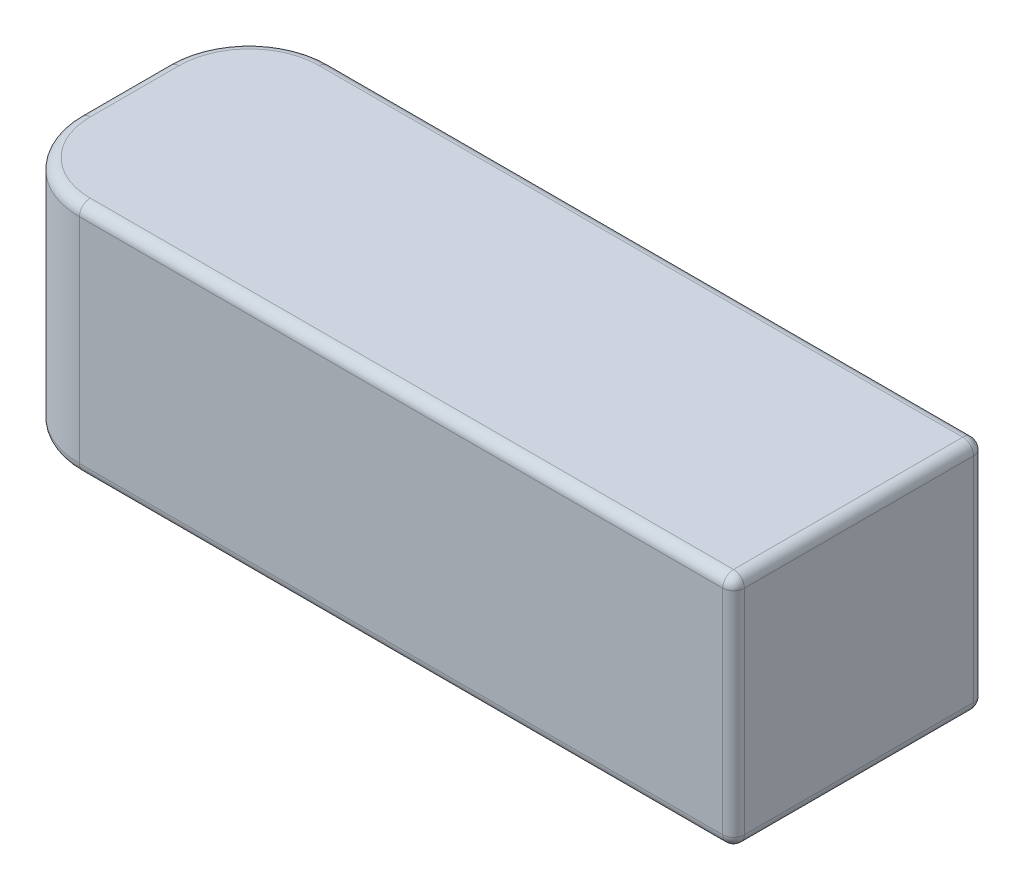
ISO-10303-21;
HEADER;
FILE_DESCRIPTION(('STEP AP214'),'2;1');
FILE_NAME('part.step','',(''),(''),'','','');
FILE_SCHEMA(('AUTOMOTIVE_DESIGN { 1 0 10303 214 1 1 1 1 }'));
ENDSEC;
DATA;
#1=APPLICATION_CONTEXT('core data for automotive mechanical design processes');
#2=APPLICATION_PROTOCOL_DEFINITION('international standard','automotive_design',2000,#1);
#3=PRODUCT_CONTEXT('',#1,'mechanical');
#4=PRODUCT('Part','Part','',(#3));
#5=PRODUCT_RELATED_PRODUCT_CATEGORY('part','',(#4));
#6=PRODUCT_DEFINITION_FORMATION('','',#4);
#7=PRODUCT_DEFINITION_CONTEXT('part definition',#1,'design');
#8=PRODUCT_DEFINITION('design','',#6,#7);
#9=PRODUCT_DEFINITION_SHAPE('','',#8);
#10=(LENGTH_UNIT() NAMED_UNIT(*) SI_UNIT(.MILLI.,.METRE.));
#11=(NAMED_UNIT(*) PLANE_ANGLE_UNIT() SI_UNIT($,.RADIAN.));
#12=(NAMED_UNIT(*) SI_UNIT($,.STERADIAN.) SOLID_ANGLE_UNIT());
#13=UNCERTAINTY_MEASURE_WITH_UNIT(LENGTH_MEASURE(1.E-05),#10,'distance_accuracy_value','');
#14=(GEOMETRIC_REPRESENTATION_CONTEXT(3) GLOBAL_UNCERTAINTY_ASSIGNED_CONTEXT((#13)) GLOBAL_UNIT_ASSIGNED_CONTEXT((#10,
#11,#12)) REPRESENTATION_CONTEXT('',''));
#15=CARTESIAN_POINT('',(0.,0.,0.));
#16=DIRECTION('',(0.,0.,1.));
#17=DIRECTION('',(1.,0.,0.));
#18=AXIS2_PLACEMENT_3D('',#15,#16,#17);
#19=CARTESIAN_POINT('',(68.,43.5,-23.2));
#20=DIRECTION('',(-1.,0.,0.));
#21=DIRECTION('',(0.,0.,1.));
#22=AXIS2_PLACEMENT_3D('',#19,#20,#21);
#23=PLANE('',#22);
#24=DIRECTION('',(0.,-1.,0.));
#25=VECTOR('',#24,1.);
#26=CARTESIAN_POINT('',(68.,43.5,-21.2));
#27=LINE('',#26,#25);
#28=CARTESIAN_POINT('',(68.,2.,-21.2));
#29=VERTEX_POINT('',#28);
#30=CARTESIAN_POINT('',(68.,41.5,-21.2));
#31=VERTEX_POINT('',#30);
#32=EDGE_CURVE('E164',#29,#31,#27,.F.);
#33=ORIENTED_EDGE('',*,*,#32,.T.);
#34=DIRECTION('',(0.,0.,-1.));
#35=VECTOR('',#34,1.);
#36=CARTESIAN_POINT('',(68.,41.5,23.2));
#37=LINE('',#36,#35);
#38=CARTESIAN_POINT('',(68.,41.5,21.2));
#39=VERTEX_POINT('',#38);
#40=EDGE_CURVE('E168',#31,#39,#37,.F.);
#41=ORIENTED_EDGE('',*,*,#40,.T.);
#42=DIRECTION('',(0.,-1.,0.));
#43=VECTOR('',#42,1.);
#44=CARTESIAN_POINT('',(68.,43.5,21.2));
#45=LINE('',#44,#43);
#46=CARTESIAN_POINT('',(68.,2.,21.2));
#47=VERTEX_POINT('',#46);
#48=EDGE_CURVE('E141',#39,#47,#45,.T.);
#49=ORIENTED_EDGE('',*,*,#48,.T.);
#50=DIRECTION('',(0.,0.,-1.));
#51=VECTOR('',#50,1.);
#52=CARTESIAN_POINT('',(68.,2.,-23.2));
#53=LINE('',#52,#51);
#54=EDGE_CURVE('E158',#47,#29,#53,.T.);
#55=ORIENTED_EDGE('',*,*,#54,.T.);
#56=EDGE_LOOP('',(#33,#41,#49,#55));
#57=FACE_BOUND('',#56,.T.);
#58=ADVANCED_FACE('F36',(#57),#23,.F.);
#59=CARTESIAN_POINT('',(-68.,43.5,-23.2));
#60=DIRECTION('',(0.,0.,1.));
#61=DIRECTION('',(1.,0.,0.));
#62=AXIS2_PLACEMENT_3D('',#59,#60,#61);
#63=PLANE('',#62);
#64=DIRECTION('',(0.,-1.,0.));
#65=VECTOR('',#64,1.);
#66=CARTESIAN_POINT('',(-53.,43.5,-23.2));
#67=LINE('',#66,#65);
#68=CARTESIAN_POINT('',(-53.,2.,-23.2));
#69=VERTEX_POINT('',#68);
#70=CARTESIAN_POINT('',(-53.,41.5,-23.2));
#71=VERTEX_POINT('',#70);
#72=EDGE_CURVE('E274',#69,#71,#67,.F.);
#73=ORIENTED_EDGE('',*,*,#72,.T.);
#74=DIRECTION('',(-1.,0.,0.));
#75=VECTOR('',#74,1.);
#76=CARTESIAN_POINT('',(68.,41.5,-23.2));
#77=LINE('',#76,#75);
#78=CARTESIAN_POINT('',(66.,41.5,-23.2));
#79=VERTEX_POINT('',#78);
#80=EDGE_CURVE('E183',#71,#79,#77,.F.);
#81=ORIENTED_EDGE('',*,*,#80,.T.);
#82=DIRECTION('',(0.,-1.,0.));
#83=VECTOR('',#82,1.);
#84=CARTESIAN_POINT('',(66.,43.5,-23.2));
#85=LINE('',#84,#83);
#86=CARTESIAN_POINT('',(66.,2.,-23.2));
#87=VERTEX_POINT('',#86);
#88=EDGE_CURVE('E181',#79,#87,#85,.T.);
#89=ORIENTED_EDGE('',*,*,#88,.T.);
#90=DIRECTION('',(-1.,0.,0.));
#91=VECTOR('',#90,1.);
#92=CARTESIAN_POINT('',(-68.,2.,-23.2));
#93=LINE('',#92,#91);
#94=EDGE_CURVE('E179',#87,#69,#93,.T.);
#95=ORIENTED_EDGE('',*,*,#94,.T.);
#96=EDGE_LOOP('',(#73,#81,#89,#95));
#97=FACE_BOUND('',#96,.T.);
#98=ADVANCED_FACE('F305',(#97),#63,.F.);
#99=CARTESIAN_POINT('',(-68.,43.5,-23.2));
#100=DIRECTION('',(1.,0.,0.));
#101=DIRECTION('',(0.,0.,-1.));
#102=AXIS2_PLACEMENT_3D('',#99,#100,#101);
#103=PLANE('',#102);
#104=DIRECTION('',(0.,-1.,0.));
#105=VECTOR('',#104,1.);
#106=CARTESIAN_POINT('',(-68.,43.5,8.2));
#107=LINE('',#106,#105);
#108=CARTESIAN_POINT('',(-68.,2.,8.2));
#109=VERTEX_POINT('',#108);
#110=CARTESIAN_POINT('',(-68.,41.5,8.2));
#111=VERTEX_POINT('',#110);
#112=EDGE_CURVE('E263',#109,#111,#107,.F.);
#113=ORIENTED_EDGE('',*,*,#112,.T.);
#114=DIRECTION('',(0.,0.,1.));
#115=VECTOR('',#114,1.);
#116=CARTESIAN_POINT('',(-68.,41.5,-8.2));
#117=LINE('',#116,#115);
#118=CARTESIAN_POINT('',(-68.,41.5,-8.2));
#119=VERTEX_POINT('',#118);
#120=EDGE_CURVE('E204',#111,#119,#117,.F.);
#121=ORIENTED_EDGE('',*,*,#120,.T.);
#122=DIRECTION('',(0.,-1.,0.));
#123=VECTOR('',#122,1.);
#124=CARTESIAN_POINT('',(-68.,43.5,-8.2));
#125=LINE('',#124,#123);
#126=CARTESIAN_POINT('',(-68.,2.,-8.2));
#127=VERTEX_POINT('',#126);
#128=EDGE_CURVE('E269',#119,#127,#125,.T.);
#129=ORIENTED_EDGE('',*,*,#128,.T.);
#130=DIRECTION('',(0.,0.,1.));
#131=VECTOR('',#130,1.);
#132=CARTESIAN_POINT('',(-68.,2.,-23.2));
#133=LINE('',#132,#131);
#134=EDGE_CURVE('E202',#127,#109,#133,.T.);
#135=ORIENTED_EDGE('',*,*,#134,.T.);
#136=EDGE_LOOP('',(#113,#121,#129,#135));
#137=FACE_BOUND('',#136,.T.);
#138=ADVANCED_FACE('F310',(#137),#103,.F.);
#139=CARTESIAN_POINT('',(-68.,43.5,23.2));
#140=DIRECTION('',(0.,0.,-1.));
#141=DIRECTION('',(-1.,0.,0.));
#142=AXIS2_PLACEMENT_3D('',#139,#140,#141);
#143=PLANE('',#142);
#144=DIRECTION('',(0.,-1.,0.));
#145=VECTOR('',#144,1.);
#146=CARTESIAN_POINT('',(66.,43.5,23.2));
#147=LINE('',#146,#145);
#148=CARTESIAN_POINT('',(66.,2.,23.2));
#149=VERTEX_POINT('',#148);
#150=CARTESIAN_POINT('',(66.,41.5,23.2));
#151=VERTEX_POINT('',#150);
#152=EDGE_CURVE('E143',#149,#151,#147,.F.);
#153=ORIENTED_EDGE('',*,*,#152,.T.);
#154=DIRECTION('',(1.,0.,0.));
#155=VECTOR('',#154,1.);
#156=CARTESIAN_POINT('',(-53.,41.5,23.2));
#157=LINE('',#156,#155);
#158=CARTESIAN_POINT('',(-53.,41.5,23.2));
#159=VERTEX_POINT('',#158);
#160=EDGE_CURVE('E177',#151,#159,#157,.F.);
#161=ORIENTED_EDGE('',*,*,#160,.T.);
#162=DIRECTION('',(0.,-1.,0.));
#163=VECTOR('',#162,1.);
#164=CARTESIAN_POINT('',(-53.,43.5,23.2));
#165=LINE('',#164,#163);
#166=CARTESIAN_POINT('',(-53.,2.,23.2));
#167=VERTEX_POINT('',#166);
#168=EDGE_CURVE('E165',#159,#167,#165,.T.);
#169=ORIENTED_EDGE('',*,*,#168,.T.);
#170=DIRECTION('',(1.,0.,0.));
#171=VECTOR('',#170,1.);
#172=CARTESIAN_POINT('',(-68.,2.,23.2));
#173=LINE('',#172,#171);
#174=EDGE_CURVE('E171',#167,#149,#173,.T.);
#175=ORIENTED_EDGE('',*,*,#174,.T.);
#176=EDGE_LOOP('',(#153,#161,#169,#175));
#177=FACE_BOUND('',#176,.T.);
#178=ADVANCED_FACE('F283',(#177),#143,.F.);
#179=CARTESIAN_POINT('',(0.,43.5,0.));
#180=DIRECTION('',(0.,1.,0.));
#181=DIRECTION('',(0.,0.,1.));
#182=AXIS2_PLACEMENT_3D('',#179,#180,#181);
#183=PLANE('',#182);
#184=DIRECTION('',(1.,0.,0.));
#185=VECTOR('',#184,1.);
#186=CARTESIAN_POINT('',(68.,43.5,21.2));
#187=LINE('',#186,#185);
#188=CARTESIAN_POINT('',(-53.,43.5,21.2));
#189=VERTEX_POINT('',#188);
#190=CARTESIAN_POINT('',(66.,43.5,21.2));
#191=VERTEX_POINT('',#190);
#192=EDGE_CURVE('E193',#189,#191,#187,.T.);
#193=ORIENTED_EDGE('',*,*,#192,.T.);
#194=DIRECTION('',(0.,0.,-1.));
#195=VECTOR('',#194,1.);
#196=CARTESIAN_POINT('',(66.,43.5,-23.2));
#197=LINE('',#196,#195);
#198=CARTESIAN_POINT('',(66.,43.5,-21.2));
#199=VERTEX_POINT('',#198);
#200=EDGE_CURVE('E195',#191,#199,#197,.T.);
#201=ORIENTED_EDGE('',*,*,#200,.T.);
#202=DIRECTION('',(-1.,0.,0.));
#203=VECTOR('',#202,1.);
#204=CARTESIAN_POINT('',(-53.,43.5,-21.2));
#205=LINE('',#204,#203);
#206=CARTESIAN_POINT('',(-53.,43.5,-21.2));
#207=VERTEX_POINT('',#206);
#208=EDGE_CURVE('E185',#199,#207,#205,.T.);
#209=ORIENTED_EDGE('',*,*,#208,.T.);
#210=CARTESIAN_POINT('',(-53.,43.5,-8.2));
#211=DIRECTION('',(0.,1.,0.));
#212=DIRECTION('',(0.,0.,1.));
#213=AXIS2_PLACEMENT_3D('',#210,#211,#212);
#214=CIRCLE('',#213,13.);
#215=CARTESIAN_POINT('',(-66.,43.5,-8.2));
#216=VERTEX_POINT('',#215);
#217=EDGE_CURVE('E187',#207,#216,#214,.T.);
#218=ORIENTED_EDGE('',*,*,#217,.T.);
#219=DIRECTION('',(0.,0.,1.));
#220=VECTOR('',#219,1.);
#221=CARTESIAN_POINT('',(-66.,43.5,8.2));
#222=LINE('',#221,#220);
#223=CARTESIAN_POINT('',(-66.,43.5,8.2));
#224=VERTEX_POINT('',#223);
#225=EDGE_CURVE('E189',#216,#224,#222,.T.);
#226=ORIENTED_EDGE('',*,*,#225,.T.);
#227=CARTESIAN_POINT('',(-53.,43.5,8.2));
#228=DIRECTION('',(0.,1.,0.));
#229=DIRECTION('',(0.,0.,1.));
#230=AXIS2_PLACEMENT_3D('',#227,#228,#229);
#231=CIRCLE('',#230,13.);
#232=EDGE_CURVE('E191',#224,#189,#231,.T.);
#233=ORIENTED_EDGE('',*,*,#232,.T.);
#234=EDGE_LOOP('',(#193,#201,#209,#218,#226,#233));
#235=FACE_BOUND('',#234,.T.);
#236=ADVANCED_FACE('F478',(#235),#183,.T.);
#237=CARTESIAN_POINT('',(0.,0.,0.));
#238=DIRECTION('',(0.,1.,0.));
#239=DIRECTION('',(0.,0.,1.));
#240=AXIS2_PLACEMENT_3D('',#237,#238,#239);
#241=PLANE('',#240);
#242=DIRECTION('',(1.,0.,0.));
#243=VECTOR('',#242,1.);
#244=CARTESIAN_POINT('',(0.,0.,21.2));
#245=LINE('',#244,#243);
#246=CARTESIAN_POINT('',(66.,0.,21.2));
#247=VERTEX_POINT('',#246);
#248=CARTESIAN_POINT('',(-53.,0.,21.2));
#249=VERTEX_POINT('',#248);
#250=EDGE_CURVE('E45',#247,#249,#245,.F.);
#251=ORIENTED_EDGE('',*,*,#250,.T.);
#252=CARTESIAN_POINT('',(-53.,0.,8.2));
#253=DIRECTION('',(0.,1.,0.));
#254=DIRECTION('',(0.,0.,1.));
#255=AXIS2_PLACEMENT_3D('',#252,#253,#254);
#256=CIRCLE('',#255,13.);
#257=CARTESIAN_POINT('',(-66.,0.,8.2));
#258=VERTEX_POINT('',#257);
#259=EDGE_CURVE('E11',#249,#258,#256,.F.);
#260=ORIENTED_EDGE('',*,*,#259,.T.);
#261=DIRECTION('',(0.,0.,1.));
#262=VECTOR('',#261,1.);
#263=CARTESIAN_POINT('',(-66.,0.,0.));
#264=LINE('',#263,#262);
#265=CARTESIAN_POINT('',(-66.,0.,-8.2));
#266=VERTEX_POINT('',#265);
#267=EDGE_CURVE('E210',#258,#266,#264,.F.);
#268=ORIENTED_EDGE('',*,*,#267,.T.);
#269=CARTESIAN_POINT('',(-53.,0.,-8.2));
#270=DIRECTION('',(0.,1.,0.));
#271=DIRECTION('',(0.,0.,1.));
#272=AXIS2_PLACEMENT_3D('',#269,#270,#271);
#273=CIRCLE('',#272,13.);
#274=CARTESIAN_POINT('',(-53.,0.,-21.2));
#275=VERTEX_POINT('',#274);
#276=EDGE_CURVE('E212',#266,#275,#273,.F.);
#277=ORIENTED_EDGE('',*,*,#276,.T.);
#278=DIRECTION('',(-1.,0.,0.));
#279=VECTOR('',#278,1.);
#280=CARTESIAN_POINT('',(0.,0.,-21.2));
#281=LINE('',#280,#279);
#282=CARTESIAN_POINT('',(66.,0.,-21.2));
#283=VERTEX_POINT('',#282);
#284=EDGE_CURVE('E214',#275,#283,#281,.F.);
#285=ORIENTED_EDGE('',*,*,#284,.T.);
#286=DIRECTION('',(0.,0.,-1.));
#287=VECTOR('',#286,1.);
#288=CARTESIAN_POINT('',(66.,0.,0.));
#289=LINE('',#288,#287);
#290=EDGE_CURVE('E56',#283,#247,#289,.F.);
#291=ORIENTED_EDGE('',*,*,#290,.T.);
#292=EDGE_LOOP('',(#251,#260,#268,#277,#285,#291));
#293=FACE_BOUND('',#292,.T.);
#294=ADVANCED_FACE('F319',(#293),#241,.F.);
#295=CARTESIAN_POINT('',(-53.,43.5,-8.2));
#296=DIRECTION('',(0.,-1.,0.));
#297=DIRECTION('',(0.,0.,-1.));
#298=AXIS2_PLACEMENT_3D('',#295,#296,#297);
#299=CYLINDRICAL_SURFACE('',#298,15.);
#300=ORIENTED_EDGE('',*,*,#128,.F.);
#301=CARTESIAN_POINT('',(-53.,41.5,-8.2));
#302=DIRECTION('',(0.,1.,0.));
#303=DIRECTION('',(0.,0.,1.));
#304=AXIS2_PLACEMENT_3D('',#301,#302,#303);
#305=CIRCLE('',#304,15.);
#306=EDGE_CURVE('E208',#119,#71,#305,.F.);
#307=ORIENTED_EDGE('',*,*,#306,.T.);
#308=ORIENTED_EDGE('',*,*,#72,.F.);
#309=CARTESIAN_POINT('',(-53.,2.,-8.2));
#310=DIRECTION('',(0.,1.,0.));
#311=DIRECTION('',(0.,0.,1.));
#312=AXIS2_PLACEMENT_3D('',#309,#310,#311);
#313=CIRCLE('',#312,15.);
#314=EDGE_CURVE('E206',#69,#127,#313,.T.);
#315=ORIENTED_EDGE('',*,*,#314,.T.);
#316=EDGE_LOOP('',(#300,#307,#308,#315));
#317=FACE_BOUND('',#316,.T.);
#318=ADVANCED_FACE('F315',(#317),#299,.T.);
#319=CARTESIAN_POINT('',(-53.,43.5,8.2));
#320=DIRECTION('',(0.,-1.,0.));
#321=DIRECTION('',(0.,0.,-1.));
#322=AXIS2_PLACEMENT_3D('',#319,#320,#321);
#323=CYLINDRICAL_SURFACE('',#322,15.);
#324=ORIENTED_EDGE('',*,*,#168,.F.);
#325=CARTESIAN_POINT('',(-53.,41.5,8.2));
#326=DIRECTION('',(0.,1.,0.));
#327=DIRECTION('',(0.,0.,1.));
#328=AXIS2_PLACEMENT_3D('',#325,#326,#327);
#329=CIRCLE('',#328,15.);
#330=EDGE_CURVE('E200',#159,#111,#329,.F.);
#331=ORIENTED_EDGE('',*,*,#330,.T.);
#332=ORIENTED_EDGE('',*,*,#112,.F.);
#333=CARTESIAN_POINT('',(-53.,2.,8.2));
#334=DIRECTION('',(0.,1.,0.));
#335=DIRECTION('',(0.,0.,1.));
#336=AXIS2_PLACEMENT_3D('',#333,#334,#335);
#337=CIRCLE('',#336,15.);
#338=EDGE_CURVE('E198',#109,#167,#337,.T.);
#339=ORIENTED_EDGE('',*,*,#338,.T.);
#340=EDGE_LOOP('',(#324,#331,#332,#339));
#341=FACE_BOUND('',#340,.T.);
#342=ADVANCED_FACE('F318',(#341),#323,.T.);
#343=CARTESIAN_POINT('',(-53.,41.5,-8.2));
#344=DIRECTION('',(0.,1.,0.));
#345=DIRECTION('',(0.,0.,1.));
#346=AXIS2_PLACEMENT_3D('',#343,#344,#345);
#347=TOROIDAL_SURFACE('',#346,13.,2.);
#348=CARTESIAN_POINT('',(-53.,41.5,-21.2));
#349=DIRECTION('',(1.,0.,0.));
#350=DIRECTION('',(0.,0.,-1.));
#351=AXIS2_PLACEMENT_3D('',#348,#349,#350);
#352=CIRCLE('',#351,2.);
#353=EDGE_CURVE('E256',#71,#207,#352,.T.);
#354=ORIENTED_EDGE('',*,*,#353,.F.);
#355=ORIENTED_EDGE('',*,*,#306,.F.);
#356=CARTESIAN_POINT('',(-66.,41.5,-8.2));
#357=DIRECTION('',(0.,0.,1.));
#358=DIRECTION('',(1.,0.,0.));
#359=AXIS2_PLACEMENT_3D('',#356,#357,#358);
#360=CIRCLE('',#359,2.);
#361=EDGE_CURVE('E40',#216,#119,#360,.T.);
#362=ORIENTED_EDGE('',*,*,#361,.F.);
#363=ORIENTED_EDGE('',*,*,#217,.F.);
#364=EDGE_LOOP('',(#354,#355,#362,#363));
#365=FACE_BOUND('',#364,.T.);
#366=ADVANCED_FACE('F38',(#365),#347,.T.);
#367=CARTESIAN_POINT('',(-53.,2.,-8.2));
#368=DIRECTION('',(0.,1.,0.));
#369=DIRECTION('',(0.,0.,1.));
#370=AXIS2_PLACEMENT_3D('',#367,#368,#369);
#371=TOROIDAL_SURFACE('',#370,13.,2.);
#372=CARTESIAN_POINT('',(-66.,2.,-8.2));
#373=DIRECTION('',(0.,0.,1.));
#374=DIRECTION('',(1.,0.,0.));
#375=AXIS2_PLACEMENT_3D('',#372,#373,#374);
#376=CIRCLE('',#375,2.);
#377=EDGE_CURVE('E251',#127,#266,#376,.T.);
#378=ORIENTED_EDGE('',*,*,#377,.F.);
#379=ORIENTED_EDGE('',*,*,#314,.F.);
#380=CARTESIAN_POINT('',(-53.,2.,-21.2));
#381=DIRECTION('',(1.,0.,0.));
#382=DIRECTION('',(0.,0.,-1.));
#383=AXIS2_PLACEMENT_3D('',#380,#381,#382);
#384=CIRCLE('',#383,2.);
#385=EDGE_CURVE('E254',#275,#69,#384,.T.);
#386=ORIENTED_EDGE('',*,*,#385,.F.);
#387=ORIENTED_EDGE('',*,*,#276,.F.);
#388=EDGE_LOOP('',(#378,#379,#386,#387));
#389=FACE_BOUND('',#388,.T.);
#390=ADVANCED_FACE('F446',(#389),#371,.T.);
#391=CARTESIAN_POINT('',(-66.,41.5,0.));
#392=DIRECTION('',(0.,0.,-1.));
#393=DIRECTION('',(-1.,0.,0.));
#394=AXIS2_PLACEMENT_3D('',#391,#392,#393);
#395=CYLINDRICAL_SURFACE('',#394,2.);
#396=ORIENTED_EDGE('',*,*,#361,.T.);
#397=ORIENTED_EDGE('',*,*,#120,.F.);
#398=CARTESIAN_POINT('',(-66.,41.5,8.2));
#399=DIRECTION('',(0.,0.,1.));
#400=DIRECTION('',(1.,0.,0.));
#401=AXIS2_PLACEMENT_3D('',#398,#399,#400);
#402=CIRCLE('',#401,2.);
#403=EDGE_CURVE('E248',#224,#111,#402,.T.);
#404=ORIENTED_EDGE('',*,*,#403,.F.);
#405=ORIENTED_EDGE('',*,*,#225,.F.);
#406=EDGE_LOOP('',(#396,#397,#404,#405));
#407=FACE_BOUND('',#406,.T.);
#408=ADVANCED_FACE('F438',(#407),#395,.T.);
#409=CARTESIAN_POINT('',(0.,41.5,-21.2));
#410=DIRECTION('',(1.,0.,0.));
#411=DIRECTION('',(0.,0.,-1.));
#412=AXIS2_PLACEMENT_3D('',#409,#410,#411);
#413=CYLINDRICAL_SURFACE('',#412,2.);
#414=ORIENTED_EDGE('',*,*,#353,.T.);
#415=ORIENTED_EDGE('',*,*,#208,.F.);
#416=CARTESIAN_POINT('',(66.,41.5,-21.2));
#417=DIRECTION('',(1.,0.,0.));
#418=DIRECTION('',(0.,1.,0.));
#419=AXIS2_PLACEMENT_3D('',#416,#417,#418);
#420=CIRCLE('',#419,2.);
#421=EDGE_CURVE('E245',#79,#199,#420,.T.);
#422=ORIENTED_EDGE('',*,*,#421,.F.);
#423=ORIENTED_EDGE('',*,*,#80,.F.);
#424=EDGE_LOOP('',(#414,#415,#422,#423));
#425=FACE_BOUND('',#424,.T.);
#426=ADVANCED_FACE('F429',(#425),#413,.T.);
#427=CARTESIAN_POINT('',(66.,43.5,-21.2));
#428=DIRECTION('',(0.,-1.,0.));
#429=DIRECTION('',(0.,0.,-1.));
#430=AXIS2_PLACEMENT_3D('',#427,#428,#429);
#431=CYLINDRICAL_SURFACE('',#430,2.);
#432=CARTESIAN_POINT('',(66.,2.,-21.2));
#433=DIRECTION('',(0.,-1.,0.));
#434=DIRECTION('',(0.,0.,-1.));
#435=AXIS2_PLACEMENT_3D('',#432,#433,#434);
#436=CIRCLE('',#435,2.);
#437=EDGE_CURVE('E239',#87,#29,#436,.T.);
#438=ORIENTED_EDGE('',*,*,#437,.F.);
#439=ORIENTED_EDGE('',*,*,#88,.F.);
#440=CARTESIAN_POINT('',(66.,41.5,-21.2));
#441=DIRECTION('',(0.,1.,0.));
#442=DIRECTION('',(0.,0.,1.));
#443=AXIS2_PLACEMENT_3D('',#440,#441,#442);
#444=CIRCLE('',#443,2.);
#445=EDGE_CURVE('E242',#31,#79,#444,.T.);
#446=ORIENTED_EDGE('',*,*,#445,.F.);
#447=ORIENTED_EDGE('',*,*,#32,.F.);
#448=EDGE_LOOP('',(#438,#439,#446,#447));
#449=FACE_BOUND('',#448,.T.);
#450=ADVANCED_FACE('F420',(#449),#431,.T.);
#451=CARTESIAN_POINT('',(-68.,2.,-21.2));
#452=DIRECTION('',(-1.,0.,0.));
#453=DIRECTION('',(0.,0.,1.));
#454=AXIS2_PLACEMENT_3D('',#451,#452,#453);
#455=CYLINDRICAL_SURFACE('',#454,2.);
#456=ORIENTED_EDGE('',*,*,#385,.T.);
#457=ORIENTED_EDGE('',*,*,#94,.F.);
#458=CARTESIAN_POINT('',(66.,2.,-21.2));
#459=DIRECTION('',(1.,0.,0.));
#460=DIRECTION('',(0.,0.,-1.));
#461=AXIS2_PLACEMENT_3D('',#458,#459,#460);
#462=CIRCLE('',#461,2.);
#463=EDGE_CURVE('E236',#283,#87,#462,.T.);
#464=ORIENTED_EDGE('',*,*,#463,.F.);
#465=ORIENTED_EDGE('',*,*,#284,.F.);
#466=EDGE_LOOP('',(#456,#457,#464,#465));
#467=FACE_BOUND('',#466,.T.);
#468=ADVANCED_FACE('F411',(#467),#455,.T.);
#469=CARTESIAN_POINT('',(-66.,2.,-23.2));
#470=DIRECTION('',(0.,0.,1.));
#471=DIRECTION('',(1.,0.,0.));
#472=AXIS2_PLACEMENT_3D('',#469,#470,#471);
#473=CYLINDRICAL_SURFACE('',#472,2.);
#474=ORIENTED_EDGE('',*,*,#377,.T.);
#475=ORIENTED_EDGE('',*,*,#267,.F.);
#476=CARTESIAN_POINT('',(-66.,2.,8.2));
#477=DIRECTION('',(0.,0.,1.));
#478=DIRECTION('',(1.,0.,0.));
#479=AXIS2_PLACEMENT_3D('',#476,#477,#478);
#480=CIRCLE('',#479,2.);
#481=EDGE_CURVE('E234',#109,#258,#480,.T.);
#482=ORIENTED_EDGE('',*,*,#481,.F.);
#483=ORIENTED_EDGE('',*,*,#134,.F.);
#484=EDGE_LOOP('',(#474,#475,#482,#483));
#485=FACE_BOUND('',#484,.T.);
#486=ADVANCED_FACE('F402',(#485),#473,.T.);
#487=CARTESIAN_POINT('',(-53.,41.5,8.2));
#488=DIRECTION('',(0.,1.,0.));
#489=DIRECTION('',(0.,0.,1.));
#490=AXIS2_PLACEMENT_3D('',#487,#488,#489);
#491=TOROIDAL_SURFACE('',#490,13.,2.);
#492=ORIENTED_EDGE('',*,*,#403,.T.);
#493=ORIENTED_EDGE('',*,*,#330,.F.);
#494=CARTESIAN_POINT('',(-53.,41.5,21.2));
#495=DIRECTION('',(1.,0.,0.));
#496=DIRECTION('',(0.,0.,-1.));
#497=AXIS2_PLACEMENT_3D('',#494,#495,#496);
#498=CIRCLE('',#497,2.);
#499=EDGE_CURVE('E231',#189,#159,#498,.T.);
#500=ORIENTED_EDGE('',*,*,#499,.F.);
#501=ORIENTED_EDGE('',*,*,#232,.F.);
#502=EDGE_LOOP('',(#492,#493,#500,#501));
#503=FACE_BOUND('',#502,.T.);
#504=ADVANCED_FACE('F393',(#503),#491,.T.);
#505=CARTESIAN_POINT('',(66.,41.5,-21.2));
#506=DIRECTION('',(0.,0.,1.));
#507=DIRECTION('',(1.,0.,0.));
#508=AXIS2_PLACEMENT_3D('',#505,#506,#507);
#509=SPHERICAL_SURFACE('',#508,2.);
#510=ORIENTED_EDGE('',*,*,#445,.T.);
#511=ORIENTED_EDGE('',*,*,#421,.T.);
#512=CARTESIAN_POINT('',(66.,41.5,-21.2));
#513=DIRECTION('',(0.,0.,-1.));
#514=DIRECTION('',(-1.,0.,0.));
#515=AXIS2_PLACEMENT_3D('',#512,#513,#514);
#516=CIRCLE('',#515,2.);
#517=EDGE_CURVE('E229',#31,#199,#516,.F.);
#518=ORIENTED_EDGE('',*,*,#517,.F.);
#519=EDGE_LOOP('',(#510,#511,#518));
#520=FACE_BOUND('',#519,.T.);
#521=ADVANCED_FACE('F384',(#520),#509,.T.);
#522=CARTESIAN_POINT('',(66.,2.,-21.2));
#523=DIRECTION('',(0.,0.,1.));
#524=DIRECTION('',(1.,0.,0.));
#525=AXIS2_PLACEMENT_3D('',#522,#523,#524);
#526=SPHERICAL_SURFACE('',#525,2.);
#527=ORIENTED_EDGE('',*,*,#463,.T.);
#528=ORIENTED_EDGE('',*,*,#437,.T.);
#529=CARTESIAN_POINT('',(66.,2.,-21.2));
#530=DIRECTION('',(0.,0.,-1.));
#531=DIRECTION('',(-1.,0.,0.));
#532=AXIS2_PLACEMENT_3D('',#529,#530,#531);
#533=CIRCLE('',#532,2.);
#534=EDGE_CURVE('E161',#283,#29,#533,.F.);
#535=ORIENTED_EDGE('',*,*,#534,.F.);
#536=EDGE_LOOP('',(#527,#528,#535));
#537=FACE_BOUND('',#536,.T.);
#538=ADVANCED_FACE('F376',(#537),#526,.T.);
#539=CARTESIAN_POINT('',(-53.,2.,8.2));
#540=DIRECTION('',(0.,1.,0.));
#541=DIRECTION('',(0.,0.,1.));
#542=AXIS2_PLACEMENT_3D('',#539,#540,#541);
#543=TOROIDAL_SURFACE('',#542,13.,2.);
#544=ORIENTED_EDGE('',*,*,#481,.T.);
#545=ORIENTED_EDGE('',*,*,#259,.F.);
#546=CARTESIAN_POINT('',(-53.,2.,21.2));
#547=DIRECTION('',(1.,0.,0.));
#548=DIRECTION('',(0.,0.,-1.));
#549=AXIS2_PLACEMENT_3D('',#546,#547,#548);
#550=CIRCLE('',#549,2.);
#551=EDGE_CURVE('E225',#167,#249,#550,.T.);
#552=ORIENTED_EDGE('',*,*,#551,.F.);
#553=ORIENTED_EDGE('',*,*,#338,.F.);
#554=EDGE_LOOP('',(#544,#545,#552,#553));
#555=FACE_BOUND('',#554,.T.);
#556=ADVANCED_FACE('F290',(#555),#543,.T.);
#557=CARTESIAN_POINT('',(0.,41.5,21.2));
#558=DIRECTION('',(-1.,0.,0.));
#559=DIRECTION('',(0.,0.,1.));
#560=AXIS2_PLACEMENT_3D('',#557,#558,#559);
#561=CYLINDRICAL_SURFACE('',#560,2.);
#562=ORIENTED_EDGE('',*,*,#499,.T.);
#563=ORIENTED_EDGE('',*,*,#160,.F.);
#564=CARTESIAN_POINT('',(66.,41.5,21.2));
#565=DIRECTION('',(1.,0.,0.));
#566=DIRECTION('',(0.,0.,-1.));
#567=AXIS2_PLACEMENT_3D('',#564,#565,#566);
#568=CIRCLE('',#567,2.);
#569=EDGE_CURVE('E222',#191,#151,#568,.T.);
#570=ORIENTED_EDGE('',*,*,#569,.F.);
#571=ORIENTED_EDGE('',*,*,#192,.F.);
#572=EDGE_LOOP('',(#562,#563,#570,#571));
#573=FACE_BOUND('',#572,.T.);
#574=ADVANCED_FACE('F359',(#573),#561,.T.);
#575=CARTESIAN_POINT('',(66.,41.5,0.));
#576=DIRECTION('',(0.,0.,1.));
#577=DIRECTION('',(1.,0.,0.));
#578=AXIS2_PLACEMENT_3D('',#575,#576,#577);
#579=CYLINDRICAL_SURFACE('',#578,2.);
#580=ORIENTED_EDGE('',*,*,#517,.T.);
#581=ORIENTED_EDGE('',*,*,#200,.F.);
#582=CARTESIAN_POINT('',(66.,41.5,21.2));
#583=DIRECTION('',(0.,0.,1.));
#584=DIRECTION('',(0.,-1.,0.));
#585=AXIS2_PLACEMENT_3D('',#582,#583,#584);
#586=CIRCLE('',#585,2.);
#587=EDGE_CURVE('E155',#39,#191,#586,.T.);
#588=ORIENTED_EDGE('',*,*,#587,.F.);
#589=ORIENTED_EDGE('',*,*,#40,.F.);
#590=EDGE_LOOP('',(#580,#581,#588,#589));
#591=FACE_BOUND('',#590,.T.);
#592=ADVANCED_FACE('F302',(#591),#579,.T.);
#593=CARTESIAN_POINT('',(66.,2.,-23.2));
#594=DIRECTION('',(0.,0.,-1.));
#595=DIRECTION('',(-1.,0.,0.));
#596=AXIS2_PLACEMENT_3D('',#593,#594,#595);
#597=CYLINDRICAL_SURFACE('',#596,2.);
#598=ORIENTED_EDGE('',*,*,#534,.T.);
#599=ORIENTED_EDGE('',*,*,#54,.F.);
#600=CARTESIAN_POINT('',(66.,2.,21.2));
#601=DIRECTION('',(0.,0.,1.));
#602=DIRECTION('',(1.,0.,0.));
#603=AXIS2_PLACEMENT_3D('',#600,#601,#602);
#604=CIRCLE('',#603,2.);
#605=EDGE_CURVE('E149',#247,#47,#604,.T.);
#606=ORIENTED_EDGE('',*,*,#605,.F.);
#607=ORIENTED_EDGE('',*,*,#290,.F.);
#608=EDGE_LOOP('',(#598,#599,#606,#607));
#609=FACE_BOUND('',#608,.T.);
#610=ADVANCED_FACE('F159',(#609),#597,.T.);
#611=CARTESIAN_POINT('',(-68.,2.,21.2));
#612=DIRECTION('',(1.,0.,0.));
#613=DIRECTION('',(0.,0.,-1.));
#614=AXIS2_PLACEMENT_3D('',#611,#612,#613);
#615=CYLINDRICAL_SURFACE('',#614,2.);
#616=ORIENTED_EDGE('',*,*,#551,.T.);
#617=ORIENTED_EDGE('',*,*,#250,.F.);
#618=CARTESIAN_POINT('',(66.,2.,21.2));
#619=DIRECTION('',(1.,0.,0.));
#620=DIRECTION('',(0.,0.,-1.));
#621=AXIS2_PLACEMENT_3D('',#618,#619,#620);
#622=CIRCLE('',#621,2.);
#623=EDGE_CURVE('E153',#149,#247,#622,.T.);
#624=ORIENTED_EDGE('',*,*,#623,.F.);
#625=ORIENTED_EDGE('',*,*,#174,.F.);
#626=EDGE_LOOP('',(#616,#617,#624,#625));
#627=FACE_BOUND('',#626,.T.);
#628=ADVANCED_FACE('F292',(#627),#615,.T.);
#629=CARTESIAN_POINT('',(66.,41.5,21.2));
#630=DIRECTION('',(0.,0.,1.));
#631=DIRECTION('',(1.,0.,0.));
#632=AXIS2_PLACEMENT_3D('',#629,#630,#631);
#633=SPHERICAL_SURFACE('',#632,2.);
#634=ORIENTED_EDGE('',*,*,#587,.T.);
#635=ORIENTED_EDGE('',*,*,#569,.T.);
#636=CARTESIAN_POINT('',(66.,41.5,21.2));
#637=DIRECTION('',(0.,1.,0.));
#638=DIRECTION('',(0.,0.,1.));
#639=AXIS2_PLACEMENT_3D('',#636,#637,#638);
#640=CIRCLE('',#639,2.);
#641=EDGE_CURVE('E146',#39,#151,#640,.F.);
#642=ORIENTED_EDGE('',*,*,#641,.F.);
#643=EDGE_LOOP('',(#634,#635,#642));
#644=FACE_BOUND('',#643,.T.);
#645=ADVANCED_FACE('F294',(#644),#633,.T.);
#646=CARTESIAN_POINT('',(66.,2.,21.2));
#647=DIRECTION('',(0.,0.,1.));
#648=DIRECTION('',(1.,0.,0.));
#649=AXIS2_PLACEMENT_3D('',#646,#647,#648);
#650=SPHERICAL_SURFACE('',#649,2.);
#651=ORIENTED_EDGE('',*,*,#623,.T.);
#652=ORIENTED_EDGE('',*,*,#605,.T.);
#653=CARTESIAN_POINT('',(66.,2.,21.2));
#654=DIRECTION('',(0.,-1.,0.));
#655=DIRECTION('',(0.,0.,-1.));
#656=AXIS2_PLACEMENT_3D('',#653,#654,#655);
#657=CIRCLE('',#656,2.);
#658=EDGE_CURVE('E137',#149,#47,#657,.F.);
#659=ORIENTED_EDGE('',*,*,#658,.F.);
#660=EDGE_LOOP('',(#651,#652,#659));
#661=FACE_BOUND('',#660,.T.);
#662=ADVANCED_FACE('F151',(#661),#650,.T.);
#663=CARTESIAN_POINT('',(66.,43.5,21.2));
#664=DIRECTION('',(0.,-1.,0.));
#665=DIRECTION('',(0.,0.,-1.));
#666=AXIS2_PLACEMENT_3D('',#663,#664,#665);
#667=CYLINDRICAL_SURFACE('',#666,2.);
#668=ORIENTED_EDGE('',*,*,#641,.T.);
#669=ORIENTED_EDGE('',*,*,#152,.F.);
#670=ORIENTED_EDGE('',*,*,#658,.T.);
#671=ORIENTED_EDGE('',*,*,#48,.F.);
#672=EDGE_LOOP('',(#668,#669,#670,#671));
#673=FACE_BOUND('',#672,.T.);
#674=ADVANCED_FACE('F139',(#673),#667,.T.);
#675=CLOSED_SHELL('',(#58,#98,#138,#178,#236,#294,#318,#342,#366,#390,#408,#426,#450,#468,#486,
#504,#521,#538,#556,#574,#592,#610,#628,#645,#662,#674));
#676=MANIFOLD_SOLID_BREP('B2',#675);
#677=ADVANCED_BREP_SHAPE_REPRESENTATION('',(#18,#676),#14);
#678=SHAPE_DEFINITION_REPRESENTATION(#9,#677);
ENDSEC;
END-ISO-10303-21;
